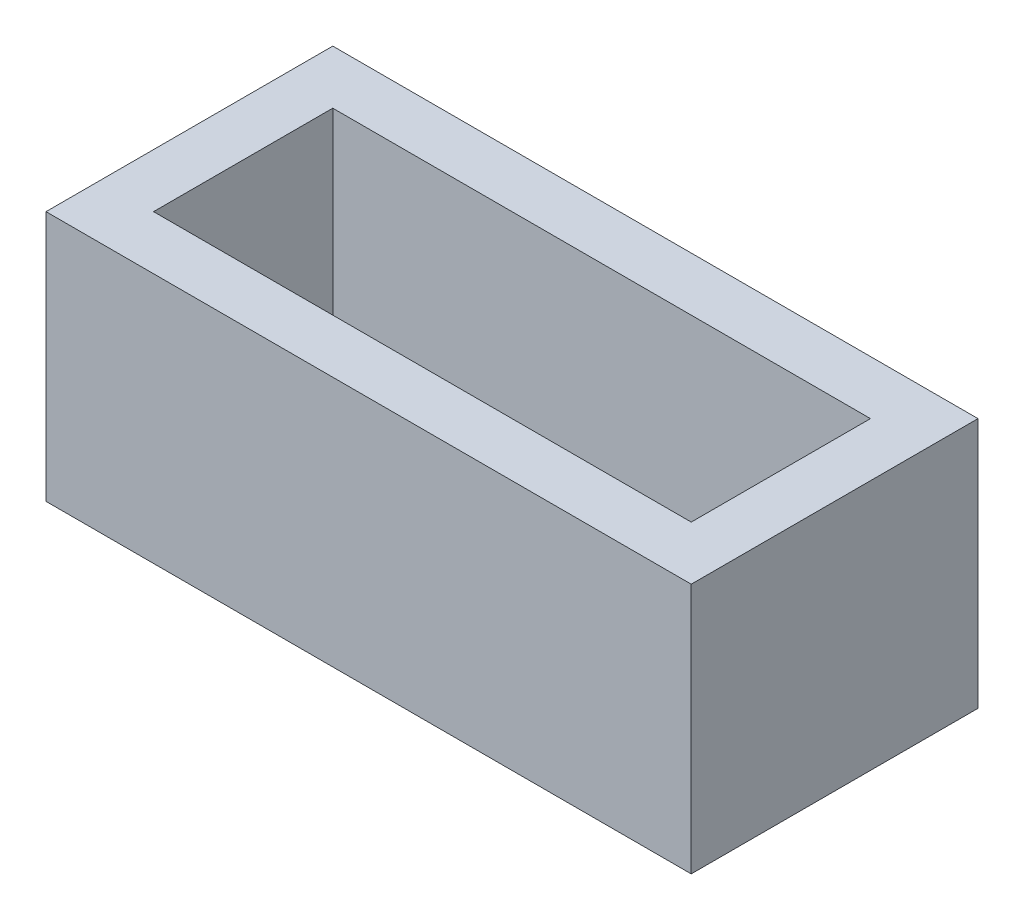
ISO-10303-21;
HEADER;
FILE_DESCRIPTION(('STEP AP214'),'2;1');
FILE_NAME('part.step','',(''),(''),'','','');
FILE_SCHEMA(('AUTOMOTIVE_DESIGN { 1 0 10303 214 1 1 1 1 }'));
ENDSEC;
DATA;
#1=APPLICATION_CONTEXT('core data for automotive mechanical design processes');
#2=APPLICATION_PROTOCOL_DEFINITION('international standard','automotive_design',2000,#1);
#3=PRODUCT_CONTEXT('',#1,'mechanical');
#4=PRODUCT('Part','Part','',(#3));
#5=PRODUCT_RELATED_PRODUCT_CATEGORY('part','',(#4));
#6=PRODUCT_DEFINITION_FORMATION('','',#4);
#7=PRODUCT_DEFINITION_CONTEXT('part definition',#1,'design');
#8=PRODUCT_DEFINITION('design','',#6,#7);
#9=PRODUCT_DEFINITION_SHAPE('','',#8);
#10=(LENGTH_UNIT() NAMED_UNIT(*) SI_UNIT(.MILLI.,.METRE.));
#11=(NAMED_UNIT(*) PLANE_ANGLE_UNIT() SI_UNIT($,.RADIAN.));
#12=(NAMED_UNIT(*) SI_UNIT($,.STERADIAN.) SOLID_ANGLE_UNIT());
#13=UNCERTAINTY_MEASURE_WITH_UNIT(LENGTH_MEASURE(1.E-05),#10,'distance_accuracy_value','');
#14=(GEOMETRIC_REPRESENTATION_CONTEXT(3) GLOBAL_UNCERTAINTY_ASSIGNED_CONTEXT((#13)) GLOBAL_UNIT_ASSIGNED_CONTEXT((#10,
#11,#12)) REPRESENTATION_CONTEXT('',''));
#15=CARTESIAN_POINT('',(0.,0.,0.));
#16=DIRECTION('',(0.,0.,1.));
#17=DIRECTION('',(1.,0.,0.));
#18=AXIS2_PLACEMENT_3D('',#15,#16,#17);
#19=CARTESIAN_POINT('',(0.,140.,0.));
#20=DIRECTION('',(0.,-1.,0.));
#21=DIRECTION('',(0.,0.,-1.));
#22=AXIS2_PLACEMENT_3D('',#19,#20,#21);
#23=PLANE('',#22);
#24=DIRECTION('',(0.,0.,1.));
#25=VECTOR('',#24,1.);
#26=CARTESIAN_POINT('',(0.,140.,0.));
#27=LINE('',#26,#25);
#28=CARTESIAN_POINT('',(0.,140.,-160.));
#29=VERTEX_POINT('',#28);
#30=CARTESIAN_POINT('',(0.,140.,0.));
#31=VERTEX_POINT('',#30);
#32=EDGE_CURVE('E138',#29,#31,#27,.T.);
#33=ORIENTED_EDGE('',*,*,#32,.T.);
#34=DIRECTION('',(1.,0.,0.));
#35=VECTOR('',#34,1.);
#36=CARTESIAN_POINT('',(0.,140.,0.));
#37=LINE('',#36,#35);
#38=CARTESIAN_POINT('',(360.,140.,0.));
#39=VERTEX_POINT('',#38);
#40=EDGE_CURVE('E141',#31,#39,#37,.T.);
#41=ORIENTED_EDGE('',*,*,#40,.T.);
#42=DIRECTION('',(0.,0.,-1.));
#43=VECTOR('',#42,1.);
#44=CARTESIAN_POINT('',(360.,140.,0.));
#45=LINE('',#44,#43);
#46=CARTESIAN_POINT('',(360.,140.,-160.));
#47=VERTEX_POINT('',#46);
#48=EDGE_CURVE('E144',#39,#47,#45,.T.);
#49=ORIENTED_EDGE('',*,*,#48,.T.);
#50=DIRECTION('',(-1.,0.,0.));
#51=VECTOR('',#50,1.);
#52=CARTESIAN_POINT('',(0.,140.,-160.));
#53=LINE('',#52,#51);
#54=EDGE_CURVE('E146',#47,#29,#53,.T.);
#55=ORIENTED_EDGE('',*,*,#54,.T.);
#56=EDGE_LOOP('',(#33,#41,#49,#55));
#57=FACE_BOUND('',#56,.T.);
#58=DIRECTION('',(0.,0.,1.));
#59=VECTOR('',#58,1.);
#60=CARTESIAN_POINT('',(30.,140.,-30.));
#61=LINE('',#60,#59);
#62=CARTESIAN_POINT('',(30.,140.,-130.));
#63=VERTEX_POINT('',#62);
#64=CARTESIAN_POINT('',(30.,140.,-30.));
#65=VERTEX_POINT('',#64);
#66=EDGE_CURVE('E102',#63,#65,#61,.T.);
#67=ORIENTED_EDGE('',*,*,#66,.F.);
#68=DIRECTION('',(-1.,0.,0.));
#69=VECTOR('',#68,1.);
#70=CARTESIAN_POINT('',(30.,140.,-130.));
#71=LINE('',#70,#69);
#72=CARTESIAN_POINT('',(330.,140.,-130.));
#73=VERTEX_POINT('',#72);
#74=EDGE_CURVE('E124',#73,#63,#71,.T.);
#75=ORIENTED_EDGE('',*,*,#74,.F.);
#76=DIRECTION('',(0.,0.,-1.));
#77=VECTOR('',#76,1.);
#78=CARTESIAN_POINT('',(330.,140.,-30.));
#79=LINE('',#78,#77);
#80=CARTESIAN_POINT('',(330.,140.,-30.));
#81=VERTEX_POINT('',#80);
#82=EDGE_CURVE('E122',#81,#73,#79,.T.);
#83=ORIENTED_EDGE('',*,*,#82,.F.);
#84=DIRECTION('',(1.,0.,0.));
#85=VECTOR('',#84,1.);
#86=CARTESIAN_POINT('',(30.,140.,-30.));
#87=LINE('',#86,#85);
#88=EDGE_CURVE('E110',#65,#81,#87,.T.);
#89=ORIENTED_EDGE('',*,*,#88,.F.);
#90=EDGE_LOOP('',(#67,#75,#83,#89));
#91=FACE_BOUND('',#90,.T.);
#92=ADVANCED_FACE('F37',(#57,#91),#23,.F.);
#93=CARTESIAN_POINT('',(0.,0.,0.));
#94=DIRECTION('',(0.,-1.,0.));
#95=DIRECTION('',(0.,0.,-1.));
#96=AXIS2_PLACEMENT_3D('',#93,#94,#95);
#97=PLANE('',#96);
#98=DIRECTION('',(0.,0.,1.));
#99=VECTOR('',#98,1.);
#100=CARTESIAN_POINT('',(0.,0.,0.));
#101=LINE('',#100,#99);
#102=CARTESIAN_POINT('',(0.,0.,-160.));
#103=VERTEX_POINT('',#102);
#104=CARTESIAN_POINT('',(0.,0.,0.));
#105=VERTEX_POINT('',#104);
#106=EDGE_CURVE('E118',#103,#105,#101,.T.);
#107=ORIENTED_EDGE('',*,*,#106,.F.);
#108=DIRECTION('',(-1.,0.,0.));
#109=VECTOR('',#108,1.);
#110=CARTESIAN_POINT('',(0.,0.,-160.));
#111=LINE('',#110,#109);
#112=CARTESIAN_POINT('',(360.,0.,-160.));
#113=VERTEX_POINT('',#112);
#114=EDGE_CURVE('E142',#113,#103,#111,.T.);
#115=ORIENTED_EDGE('',*,*,#114,.F.);
#116=DIRECTION('',(0.,0.,-1.));
#117=VECTOR('',#116,1.);
#118=CARTESIAN_POINT('',(360.,0.,0.));
#119=LINE('',#118,#117);
#120=CARTESIAN_POINT('',(360.,0.,0.));
#121=VERTEX_POINT('',#120);
#122=EDGE_CURVE('E153',#121,#113,#119,.T.);
#123=ORIENTED_EDGE('',*,*,#122,.F.);
#124=DIRECTION('',(1.,0.,0.));
#125=VECTOR('',#124,1.);
#126=CARTESIAN_POINT('',(0.,0.,0.));
#127=LINE('',#126,#125);
#128=EDGE_CURVE('E151',#105,#121,#127,.T.);
#129=ORIENTED_EDGE('',*,*,#128,.F.);
#130=EDGE_LOOP('',(#107,#115,#123,#129));
#131=FACE_BOUND('',#130,.T.);
#132=DIRECTION('',(-1.,0.,0.));
#133=VECTOR('',#132,1.);
#134=CARTESIAN_POINT('',(30.,0.,-130.));
#135=LINE('',#134,#133);
#136=CARTESIAN_POINT('',(330.,0.,-130.));
#137=VERTEX_POINT('',#136);
#138=CARTESIAN_POINT('',(30.,0.,-130.));
#139=VERTEX_POINT('',#138);
#140=EDGE_CURVE('E111',#137,#139,#135,.T.);
#141=ORIENTED_EDGE('',*,*,#140,.T.);
#142=DIRECTION('',(0.,0.,1.));
#143=VECTOR('',#142,1.);
#144=CARTESIAN_POINT('',(30.,0.,-30.));
#145=LINE('',#144,#143);
#146=CARTESIAN_POINT('',(30.,0.,-30.));
#147=VERTEX_POINT('',#146);
#148=EDGE_CURVE('E60',#139,#147,#145,.T.);
#149=ORIENTED_EDGE('',*,*,#148,.T.);
#150=DIRECTION('',(1.,0.,0.));
#151=VECTOR('',#150,1.);
#152=CARTESIAN_POINT('',(30.,0.,-30.));
#153=LINE('',#152,#151);
#154=CARTESIAN_POINT('',(330.,0.,-30.));
#155=VERTEX_POINT('',#154);
#156=EDGE_CURVE('E117',#147,#155,#153,.T.);
#157=ORIENTED_EDGE('',*,*,#156,.T.);
#158=DIRECTION('',(0.,0.,-1.));
#159=VECTOR('',#158,1.);
#160=CARTESIAN_POINT('',(330.,0.,-30.));
#161=LINE('',#160,#159);
#162=EDGE_CURVE('E130',#155,#137,#161,.T.);
#163=ORIENTED_EDGE('',*,*,#162,.T.);
#164=EDGE_LOOP('',(#141,#149,#157,#163));
#165=FACE_BOUND('',#164,.T.);
#166=ADVANCED_FACE('F171',(#131,#165),#97,.T.);
#167=CARTESIAN_POINT('',(0.,140.,0.));
#168=DIRECTION('',(1.,0.,0.));
#169=DIRECTION('',(0.,0.,-1.));
#170=AXIS2_PLACEMENT_3D('',#167,#168,#169);
#171=PLANE('',#170);
#172=ORIENTED_EDGE('',*,*,#106,.T.);
#173=DIRECTION('',(0.,-1.,0.));
#174=VECTOR('',#173,1.);
#175=CARTESIAN_POINT('',(0.,140.,0.));
#176=LINE('',#175,#174);
#177=EDGE_CURVE('E11',#31,#105,#176,.T.);
#178=ORIENTED_EDGE('',*,*,#177,.F.);
#179=ORIENTED_EDGE('',*,*,#32,.F.);
#180=DIRECTION('',(0.,-1.,0.));
#181=VECTOR('',#180,1.);
#182=CARTESIAN_POINT('',(0.,140.,-160.));
#183=LINE('',#182,#181);
#184=EDGE_CURVE('E148',#29,#103,#183,.T.);
#185=ORIENTED_EDGE('',*,*,#184,.T.);
#186=EDGE_LOOP('',(#172,#178,#179,#185));
#187=FACE_BOUND('',#186,.T.);
#188=ADVANCED_FACE('F39',(#187),#171,.F.);
#189=CARTESIAN_POINT('',(0.,140.,0.));
#190=DIRECTION('',(0.,0.,-1.));
#191=DIRECTION('',(-1.,0.,0.));
#192=AXIS2_PLACEMENT_3D('',#189,#190,#191);
#193=PLANE('',#192);
#194=ORIENTED_EDGE('',*,*,#128,.T.);
#195=DIRECTION('',(0.,-1.,0.));
#196=VECTOR('',#195,1.);
#197=CARTESIAN_POINT('',(360.,140.,0.));
#198=LINE('',#197,#196);
#199=EDGE_CURVE('E45',#39,#121,#198,.T.);
#200=ORIENTED_EDGE('',*,*,#199,.F.);
#201=ORIENTED_EDGE('',*,*,#40,.F.);
#202=ORIENTED_EDGE('',*,*,#177,.T.);
#203=EDGE_LOOP('',(#194,#200,#201,#202));
#204=FACE_BOUND('',#203,.T.);
#205=ADVANCED_FACE('F181',(#204),#193,.F.);
#206=CARTESIAN_POINT('',(360.,140.,0.));
#207=DIRECTION('',(-1.,0.,0.));
#208=DIRECTION('',(0.,0.,1.));
#209=AXIS2_PLACEMENT_3D('',#206,#207,#208);
#210=PLANE('',#209);
#211=ORIENTED_EDGE('',*,*,#122,.T.);
#212=DIRECTION('',(0.,-1.,0.));
#213=VECTOR('',#212,1.);
#214=CARTESIAN_POINT('',(360.,140.,-160.));
#215=LINE('',#214,#213);
#216=EDGE_CURVE('E158',#47,#113,#215,.T.);
#217=ORIENTED_EDGE('',*,*,#216,.F.);
#218=ORIENTED_EDGE('',*,*,#48,.F.);
#219=ORIENTED_EDGE('',*,*,#199,.T.);
#220=EDGE_LOOP('',(#211,#217,#218,#219));
#221=FACE_BOUND('',#220,.T.);
#222=ADVANCED_FACE('F165',(#221),#210,.F.);
#223=CARTESIAN_POINT('',(0.,140.,-160.));
#224=DIRECTION('',(0.,0.,1.));
#225=DIRECTION('',(1.,0.,0.));
#226=AXIS2_PLACEMENT_3D('',#223,#224,#225);
#227=PLANE('',#226);
#228=ORIENTED_EDGE('',*,*,#114,.T.);
#229=ORIENTED_EDGE('',*,*,#184,.F.);
#230=ORIENTED_EDGE('',*,*,#54,.F.);
#231=ORIENTED_EDGE('',*,*,#216,.T.);
#232=EDGE_LOOP('',(#228,#229,#230,#231));
#233=FACE_BOUND('',#232,.T.);
#234=ADVANCED_FACE('F175',(#233),#227,.F.);
#235=CARTESIAN_POINT('',(30.,140.,-30.));
#236=DIRECTION('',(1.,0.,0.));
#237=DIRECTION('',(0.,0.,-1.));
#238=AXIS2_PLACEMENT_3D('',#235,#236,#237);
#239=PLANE('',#238);
#240=ORIENTED_EDGE('',*,*,#148,.F.);
#241=DIRECTION('',(0.,-1.,0.));
#242=VECTOR('',#241,1.);
#243=CARTESIAN_POINT('',(30.,140.,-130.));
#244=LINE('',#243,#242);
#245=EDGE_CURVE('E106',#63,#139,#244,.T.);
#246=ORIENTED_EDGE('',*,*,#245,.F.);
#247=ORIENTED_EDGE('',*,*,#66,.T.);
#248=DIRECTION('',(0.,-1.,0.));
#249=VECTOR('',#248,1.);
#250=CARTESIAN_POINT('',(30.,140.,-30.));
#251=LINE('',#250,#249);
#252=EDGE_CURVE('E105',#65,#147,#251,.T.);
#253=ORIENTED_EDGE('',*,*,#252,.T.);
#254=EDGE_LOOP('',(#240,#246,#247,#253));
#255=FACE_BOUND('',#254,.T.);
#256=ADVANCED_FACE('F104',(#255),#239,.T.);
#257=CARTESIAN_POINT('',(30.,140.,-30.));
#258=DIRECTION('',(0.,0.,-1.));
#259=DIRECTION('',(-1.,0.,0.));
#260=AXIS2_PLACEMENT_3D('',#257,#258,#259);
#261=PLANE('',#260);
#262=ORIENTED_EDGE('',*,*,#156,.F.);
#263=ORIENTED_EDGE('',*,*,#252,.F.);
#264=ORIENTED_EDGE('',*,*,#88,.T.);
#265=DIRECTION('',(0.,-1.,0.));
#266=VECTOR('',#265,1.);
#267=CARTESIAN_POINT('',(330.,140.,-30.));
#268=LINE('',#267,#266);
#269=EDGE_CURVE('E119',#81,#155,#268,.T.);
#270=ORIENTED_EDGE('',*,*,#269,.T.);
#271=EDGE_LOOP('',(#262,#263,#264,#270));
#272=FACE_BOUND('',#271,.T.);
#273=ADVANCED_FACE('F114',(#272),#261,.T.);
#274=CARTESIAN_POINT('',(330.,140.,-30.));
#275=DIRECTION('',(-1.,0.,0.));
#276=DIRECTION('',(0.,0.,1.));
#277=AXIS2_PLACEMENT_3D('',#274,#275,#276);
#278=PLANE('',#277);
#279=ORIENTED_EDGE('',*,*,#162,.F.);
#280=ORIENTED_EDGE('',*,*,#269,.F.);
#281=ORIENTED_EDGE('',*,*,#82,.T.);
#282=DIRECTION('',(0.,-1.,0.));
#283=VECTOR('',#282,1.);
#284=CARTESIAN_POINT('',(330.,140.,-130.));
#285=LINE('',#284,#283);
#286=EDGE_CURVE('E52',#73,#137,#285,.T.);
#287=ORIENTED_EDGE('',*,*,#286,.T.);
#288=EDGE_LOOP('',(#279,#280,#281,#287));
#289=FACE_BOUND('',#288,.T.);
#290=ADVANCED_FACE('F204',(#289),#278,.T.);
#291=CARTESIAN_POINT('',(30.,140.,-130.));
#292=DIRECTION('',(0.,0.,1.));
#293=DIRECTION('',(1.,0.,0.));
#294=AXIS2_PLACEMENT_3D('',#291,#292,#293);
#295=PLANE('',#294);
#296=ORIENTED_EDGE('',*,*,#140,.F.);
#297=ORIENTED_EDGE('',*,*,#286,.F.);
#298=ORIENTED_EDGE('',*,*,#74,.T.);
#299=ORIENTED_EDGE('',*,*,#245,.T.);
#300=EDGE_LOOP('',(#296,#297,#298,#299));
#301=FACE_BOUND('',#300,.T.);
#302=ADVANCED_FACE('F208',(#301),#295,.T.);
#303=CLOSED_SHELL('',(#92,#166,#188,#205,#222,#234,#256,#273,#290,#302));
#304=MANIFOLD_SOLID_BREP('B2',#303);
#305=ADVANCED_BREP_SHAPE_REPRESENTATION('',(#18,#304),#14);
#306=SHAPE_DEFINITION_REPRESENTATION(#9,#305);
ENDSEC;
END-ISO-10303-21;
